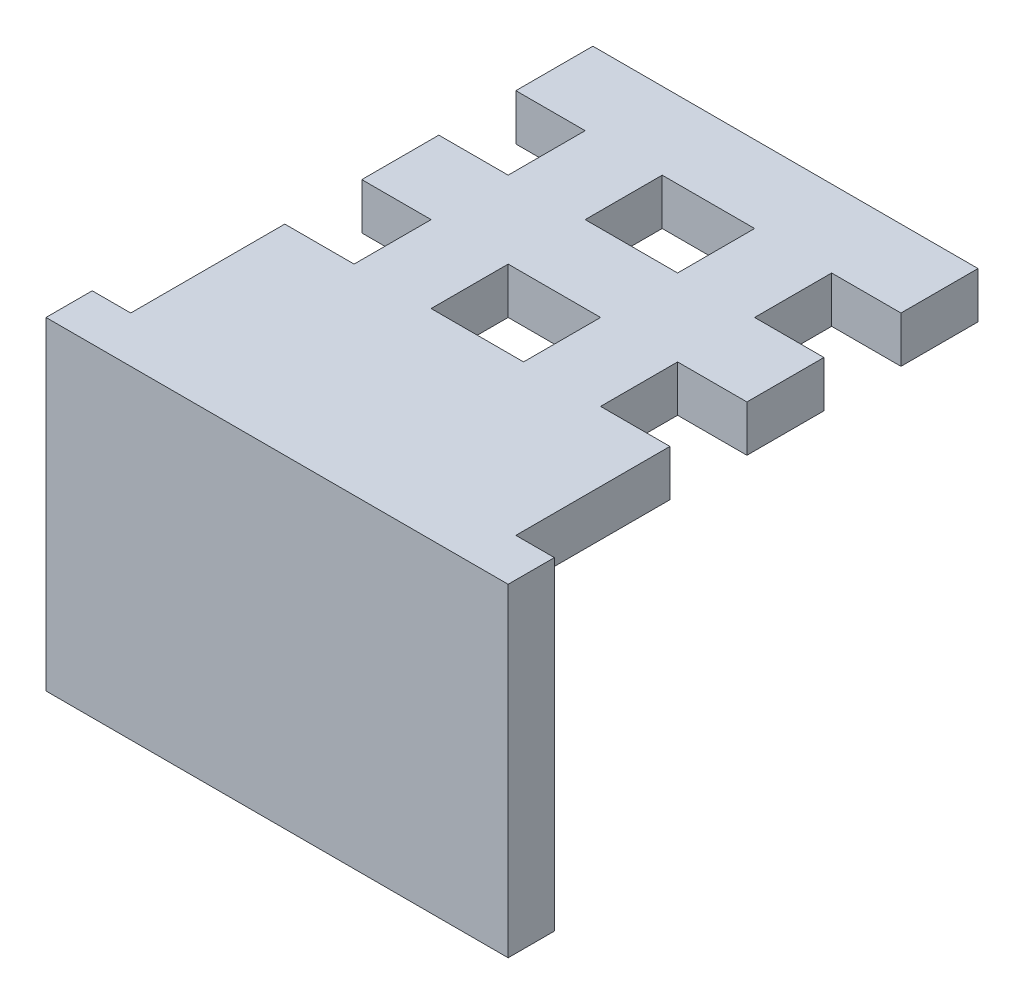
ISO-10303-21;
HEADER;
FILE_DESCRIPTION(('STEP AP214'),'2;1');
FILE_NAME('part.step','',(''),(''),'','','');
FILE_SCHEMA(('AUTOMOTIVE_DESIGN { 1 0 10303 214 1 1 1 1 }'));
ENDSEC;
DATA;
#1=APPLICATION_CONTEXT('core data for automotive mechanical design processes');
#2=APPLICATION_PROTOCOL_DEFINITION('international standard','automotive_design',2000,#1);
#3=PRODUCT_CONTEXT('',#1,'mechanical');
#4=PRODUCT('Part','Part','',(#3));
#5=PRODUCT_RELATED_PRODUCT_CATEGORY('part','',(#4));
#6=PRODUCT_DEFINITION_FORMATION('','',#4);
#7=PRODUCT_DEFINITION_CONTEXT('part definition',#1,'design');
#8=PRODUCT_DEFINITION('design','',#6,#7);
#9=PRODUCT_DEFINITION_SHAPE('','',#8);
#10=(LENGTH_UNIT() NAMED_UNIT(*) SI_UNIT(.MILLI.,.METRE.));
#11=(NAMED_UNIT(*) PLANE_ANGLE_UNIT() SI_UNIT($,.RADIAN.));
#12=(NAMED_UNIT(*) SI_UNIT($,.STERADIAN.) SOLID_ANGLE_UNIT());
#13=UNCERTAINTY_MEASURE_WITH_UNIT(LENGTH_MEASURE(1.E-05),#10,'distance_accuracy_value','');
#14=(GEOMETRIC_REPRESENTATION_CONTEXT(3) GLOBAL_UNCERTAINTY_ASSIGNED_CONTEXT((#13)) GLOBAL_UNIT_ASSIGNED_CONTEXT((#10,
#11,#12)) REPRESENTATION_CONTEXT('',''));
#15=CARTESIAN_POINT('',(0.,0.,0.));
#16=DIRECTION('',(0.,0.,1.));
#17=DIRECTION('',(1.,0.,0.));
#18=AXIS2_PLACEMENT_3D('',#15,#16,#17);
#19=CARTESIAN_POINT('',(0.,0.,-250.));
#20=DIRECTION('',(0.,0.,-1.));
#21=DIRECTION('',(-1.,0.,0.));
#22=AXIS2_PLACEMENT_3D('',#19,#20,#21);
#23=PLANE('',#22);
#24=DIRECTION('',(-1.,0.,0.));
#25=VECTOR('',#24,1.);
#26=CARTESIAN_POINT('',(125.,160.,-250.));
#27=LINE('',#26,#25);
#28=CARTESIAN_POINT('',(30.,160.,-250.));
#29=VERTEX_POINT('',#28);
#30=CARTESIAN_POINT('',(-30.,160.,-250.));
#31=VERTEX_POINT('',#30);
#32=EDGE_CURVE('E324',#29,#31,#27,.T.);
#33=ORIENTED_EDGE('',*,*,#32,.F.);
#34=DIRECTION('',(0.,-1.,0.));
#35=VECTOR('',#34,1.);
#36=CARTESIAN_POINT('',(30.,190.,-250.));
#37=LINE('',#36,#35);
#38=CARTESIAN_POINT('',(30.,190.,-250.));
#39=VERTEX_POINT('',#38);
#40=EDGE_CURVE('E419',#39,#29,#37,.T.);
#41=ORIENTED_EDGE('',*,*,#40,.F.);
#42=DIRECTION('',(1.,0.,0.));
#43=VECTOR('',#42,1.);
#44=CARTESIAN_POINT('',(125.,190.,-250.));
#45=LINE('',#44,#43);
#46=CARTESIAN_POINT('',(-30.,190.,-250.));
#47=VERTEX_POINT('',#46);
#48=EDGE_CURVE('E329',#47,#39,#45,.T.);
#49=ORIENTED_EDGE('',*,*,#48,.F.);
#50=DIRECTION('',(0.,1.,0.));
#51=VECTOR('',#50,1.);
#52=CARTESIAN_POINT('',(-30.,190.,-250.));
#53=LINE('',#52,#51);
#54=EDGE_CURVE('E288',#31,#47,#53,.T.);
#55=ORIENTED_EDGE('',*,*,#54,.F.);
#56=EDGE_LOOP('',(#33,#41,#49,#55));
#57=FACE_BOUND('',#56,.T.);
#58=ADVANCED_FACE('F36',(#57),#23,.F.);
#59=CARTESIAN_POINT('',(0.,0.,-200.));
#60=DIRECTION('',(0.,0.,-1.));
#61=DIRECTION('',(-1.,0.,0.));
#62=AXIS2_PLACEMENT_3D('',#59,#60,#61);
#63=PLANE('',#62);
#64=DIRECTION('',(0.,-1.,0.));
#65=VECTOR('',#64,1.);
#66=CARTESIAN_POINT('',(30.,190.,-200.));
#67=LINE('',#66,#65);
#68=CARTESIAN_POINT('',(30.,190.,-200.));
#69=VERTEX_POINT('',#68);
#70=CARTESIAN_POINT('',(30.,160.,-200.));
#71=VERTEX_POINT('',#70);
#72=EDGE_CURVE('E420',#69,#71,#67,.T.);
#73=ORIENTED_EDGE('',*,*,#72,.T.);
#74=DIRECTION('',(-1.,0.,0.));
#75=VECTOR('',#74,1.);
#76=CARTESIAN_POINT('',(125.,160.,-200.));
#77=LINE('',#76,#75);
#78=CARTESIAN_POINT('',(-30.,160.,-200.));
#79=VERTEX_POINT('',#78);
#80=EDGE_CURVE('E378',#71,#79,#77,.T.);
#81=ORIENTED_EDGE('',*,*,#80,.T.);
#82=DIRECTION('',(0.,1.,0.));
#83=VECTOR('',#82,1.);
#84=CARTESIAN_POINT('',(-30.,190.,-200.));
#85=LINE('',#84,#83);
#86=CARTESIAN_POINT('',(-30.,190.,-200.));
#87=VERTEX_POINT('',#86);
#88=EDGE_CURVE('E289',#79,#87,#85,.T.);
#89=ORIENTED_EDGE('',*,*,#88,.T.);
#90=DIRECTION('',(1.,0.,0.));
#91=VECTOR('',#90,1.);
#92=CARTESIAN_POINT('',(125.,190.,-200.));
#93=LINE('',#92,#91);
#94=EDGE_CURVE('E365',#87,#69,#93,.T.);
#95=ORIENTED_EDGE('',*,*,#94,.T.);
#96=EDGE_LOOP('',(#73,#81,#89,#95));
#97=FACE_BOUND('',#96,.T.);
#98=ADVANCED_FACE('F609',(#97),#63,.T.);
#99=DIRECTION('',(0.,-1.,0.));
#100=VECTOR('',#99,1.);
#101=CARTESIAN_POINT('',(-80.,190.,-250.));
#102=LINE('',#101,#100);
#103=CARTESIAN_POINT('',(-80.,190.,-250.));
#104=VERTEX_POINT('',#103);
#105=CARTESIAN_POINT('',(-80.,160.,-250.));
#106=VERTEX_POINT('',#105);
#107=EDGE_CURVE('E285',#104,#106,#102,.T.);
#108=ORIENTED_EDGE('',*,*,#107,.F.);
#109=CARTESIAN_POINT('',(-125.,190.,-250.));
#110=VERTEX_POINT('',#109);
#111=EDGE_CURVE('E310',#110,#104,#45,.T.);
#112=ORIENTED_EDGE('',*,*,#111,.F.);
#113=DIRECTION('',(0.,1.,0.));
#114=VECTOR('',#113,1.);
#115=CARTESIAN_POINT('',(-125.,190.,-250.));
#116=LINE('',#115,#114);
#117=CARTESIAN_POINT('',(-125.,160.,-250.));
#118=VERTEX_POINT('',#117);
#119=EDGE_CURVE('E323',#118,#110,#116,.T.);
#120=ORIENTED_EDGE('',*,*,#119,.F.);
#121=EDGE_CURVE('E319',#106,#118,#27,.T.);
#122=ORIENTED_EDGE('',*,*,#121,.F.);
#123=EDGE_LOOP('',(#108,#112,#120,#122));
#124=FACE_BOUND('',#123,.T.);
#125=ADVANCED_FACE('F344',(#124),#23,.F.);
#126=CARTESIAN_POINT('',(80.,190.,-250.));
#127=VERTEX_POINT('',#126);
#128=CARTESIAN_POINT('',(125.,190.,-250.));
#129=VERTEX_POINT('',#128);
#130=EDGE_CURVE('E326',#127,#129,#45,.T.);
#131=ORIENTED_EDGE('',*,*,#130,.F.);
#132=DIRECTION('',(0.,1.,0.));
#133=VECTOR('',#132,1.);
#134=CARTESIAN_POINT('',(80.,190.,-250.));
#135=LINE('',#134,#133);
#136=CARTESIAN_POINT('',(80.,160.,-250.));
#137=VERTEX_POINT('',#136);
#138=EDGE_CURVE('E59',#137,#127,#135,.T.);
#139=ORIENTED_EDGE('',*,*,#138,.F.);
#140=CARTESIAN_POINT('',(125.,160.,-250.));
#141=VERTEX_POINT('',#140);
#142=EDGE_CURVE('E320',#141,#137,#27,.T.);
#143=ORIENTED_EDGE('',*,*,#142,.F.);
#144=DIRECTION('',(0.,-1.,0.));
#145=VECTOR('',#144,1.);
#146=CARTESIAN_POINT('',(125.,190.,-250.));
#147=LINE('',#146,#145);
#148=EDGE_CURVE('E299',#129,#141,#147,.T.);
#149=ORIENTED_EDGE('',*,*,#148,.F.);
#150=EDGE_LOOP('',(#131,#139,#143,#149));
#151=FACE_BOUND('',#150,.T.);
#152=ADVANCED_FACE('F595',(#151),#23,.F.);
#153=CARTESIAN_POINT('',(125.,190.,-300.));
#154=DIRECTION('',(-1.,0.,0.));
#155=DIRECTION('',(0.,0.,1.));
#156=AXIS2_PLACEMENT_3D('',#153,#154,#155);
#157=PLANE('',#156);
#158=ORIENTED_EDGE('',*,*,#148,.T.);
#159=DIRECTION('',(0.,0.,1.));
#160=VECTOR('',#159,1.);
#161=CARTESIAN_POINT('',(125.,160.,-300.));
#162=LINE('',#161,#160);
#163=CARTESIAN_POINT('',(125.,160.,-300.));
#164=VERTEX_POINT('',#163);
#165=EDGE_CURVE('E11',#164,#141,#162,.T.);
#166=ORIENTED_EDGE('',*,*,#165,.F.);
#167=DIRECTION('',(0.,-1.,0.));
#168=VECTOR('',#167,1.);
#169=CARTESIAN_POINT('',(125.,190.,-300.));
#170=LINE('',#169,#168);
#171=CARTESIAN_POINT('',(125.,190.,-300.));
#172=VERTEX_POINT('',#171);
#173=EDGE_CURVE('E306',#172,#164,#170,.T.);
#174=ORIENTED_EDGE('',*,*,#173,.F.);
#175=DIRECTION('',(0.,0.,1.));
#176=VECTOR('',#175,1.);
#177=CARTESIAN_POINT('',(125.,190.,-300.));
#178=LINE('',#177,#176);
#179=EDGE_CURVE('E316',#172,#129,#178,.T.);
#180=ORIENTED_EDGE('',*,*,#179,.T.);
#181=EDGE_LOOP('',(#158,#166,#174,#180));
#182=FACE_BOUND('',#181,.T.);
#183=ADVANCED_FACE('F38',(#182),#157,.F.);
#184=CARTESIAN_POINT('',(125.,160.,-300.));
#185=DIRECTION('',(0.,1.,0.));
#186=DIRECTION('',(0.,0.,1.));
#187=AXIS2_PLACEMENT_3D('',#184,#185,#186);
#188=PLANE('',#187);
#189=CARTESIAN_POINT('',(-79.9999999999997,160.,-275.));
#190=DIRECTION('',(0.,-1.,0.));
#191=DIRECTION('',(0.,0.,-1.));
#192=AXIS2_PLACEMENT_3D('',#189,#190,#191);
#193=CIRCLE('',#192,10.);
#194=CARTESIAN_POINT('',(-79.9999999999997,160.,-285.));
#195=VERTEX_POINT('',#194);
#196=EDGE_CURVE('E440',#195,#195,#193,.T.);
#197=ORIENTED_EDGE('',*,*,#196,.F.);
#198=EDGE_LOOP('',(#197));
#199=FACE_BOUND('',#198,.T.);
#200=CARTESIAN_POINT('',(80.0000000000003,160.,-275.));
#201=DIRECTION('',(0.,-1.,0.));
#202=DIRECTION('',(0.,0.,-1.));
#203=AXIS2_PLACEMENT_3D('',#200,#201,#202);
#204=CIRCLE('',#203,10.);
#205=CARTESIAN_POINT('',(80.0000000000003,160.,-285.));
#206=VERTEX_POINT('',#205);
#207=EDGE_CURVE('E434',#206,#206,#204,.T.);
#208=ORIENTED_EDGE('',*,*,#207,.F.);
#209=EDGE_LOOP('',(#208));
#210=FACE_BOUND('',#209,.T.);
#211=CARTESIAN_POINT('',(0.,160.,-75.));
#212=DIRECTION('',(0.,-1.,0.));
#213=DIRECTION('',(0.,0.,-1.));
#214=AXIS2_PLACEMENT_3D('',#211,#212,#213);
#215=CIRCLE('',#214,9.99999999999999);
#216=CARTESIAN_POINT('',(0.,160.,-85.));
#217=VERTEX_POINT('',#216);
#218=EDGE_CURVE('E427',#217,#217,#215,.T.);
#219=ORIENTED_EDGE('',*,*,#218,.F.);
#220=EDGE_LOOP('',(#219));
#221=FACE_BOUND('',#220,.T.);
#222=ORIENTED_EDGE('',*,*,#142,.T.);
#223=DIRECTION('',(0.,0.,1.));
#224=VECTOR('',#223,1.);
#225=CARTESIAN_POINT('',(80.,160.,-250.));
#226=LINE('',#225,#224);
#227=CARTESIAN_POINT('',(80.,160.,-200.));
#228=VERTEX_POINT('',#227);
#229=EDGE_CURVE('E410',#137,#228,#226,.T.);
#230=ORIENTED_EDGE('',*,*,#229,.T.);
#231=CARTESIAN_POINT('',(125.,160.,-200.));
#232=VERTEX_POINT('',#231);
#233=EDGE_CURVE('E377',#232,#228,#77,.T.);
#234=ORIENTED_EDGE('',*,*,#233,.F.);
#235=DIRECTION('',(0.,0.,1.));
#236=VECTOR('',#235,1.);
#237=CARTESIAN_POINT('',(125.,160.,-200.));
#238=LINE('',#237,#236);
#239=CARTESIAN_POINT('',(125.,160.,-150.));
#240=VERTEX_POINT('',#239);
#241=EDGE_CURVE('E537',#232,#240,#238,.T.);
#242=ORIENTED_EDGE('',*,*,#241,.T.);
#243=DIRECTION('',(-1.,0.,0.));
#244=VECTOR('',#243,1.);
#245=CARTESIAN_POINT('',(125.,160.,-150.));
#246=LINE('',#245,#244);
#247=CARTESIAN_POINT('',(80.,160.,-150.));
#248=VERTEX_POINT('',#247);
#249=EDGE_CURVE('E550',#240,#248,#246,.T.);
#250=ORIENTED_EDGE('',*,*,#249,.T.);
#251=DIRECTION('',(0.,0.,-1.));
#252=VECTOR('',#251,1.);
#253=CARTESIAN_POINT('',(80.,160.,30.002));
#254=LINE('',#253,#252);
#255=CARTESIAN_POINT('',(80.,160.,-100.));
#256=VERTEX_POINT('',#255);
#257=EDGE_CURVE('E399',#256,#248,#254,.T.);
#258=ORIENTED_EDGE('',*,*,#257,.F.);
#259=DIRECTION('',(-1.,0.,0.));
#260=VECTOR('',#259,1.);
#261=CARTESIAN_POINT('',(125.,160.,-100.));
#262=LINE('',#261,#260);
#263=CARTESIAN_POINT('',(125.,160.,-100.));
#264=VERTEX_POINT('',#263);
#265=EDGE_CURVE('E496',#264,#256,#262,.T.);
#266=ORIENTED_EDGE('',*,*,#265,.F.);
#267=DIRECTION('',(0.,0.,1.));
#268=VECTOR('',#267,1.);
#269=CARTESIAN_POINT('',(125.,160.,-100.));
#270=LINE('',#269,#268);
#271=CARTESIAN_POINT('',(125.,160.,0.));
#272=VERTEX_POINT('',#271);
#273=EDGE_CURVE('E277',#264,#272,#270,.T.);
#274=ORIENTED_EDGE('',*,*,#273,.T.);
#275=DIRECTION('',(-1.,0.,0.));
#276=VECTOR('',#275,1.);
#277=CARTESIAN_POINT('',(125.,160.,0.));
#278=LINE('',#277,#276);
#279=CARTESIAN_POINT('',(-125.,160.,0.));
#280=VERTEX_POINT('',#279);
#281=EDGE_CURVE('E482',#272,#280,#278,.T.);
#282=ORIENTED_EDGE('',*,*,#281,.T.);
#283=DIRECTION('',(0.,0.,1.));
#284=VECTOR('',#283,1.);
#285=CARTESIAN_POINT('',(-125.,160.,-100.));
#286=LINE('',#285,#284);
#287=CARTESIAN_POINT('',(-125.,160.,-100.));
#288=VERTEX_POINT('',#287);
#289=EDGE_CURVE('E480',#288,#280,#286,.T.);
#290=ORIENTED_EDGE('',*,*,#289,.F.);
#291=CARTESIAN_POINT('',(-80.,160.,-100.));
#292=VERTEX_POINT('',#291);
#293=EDGE_CURVE('E515',#292,#288,#262,.T.);
#294=ORIENTED_EDGE('',*,*,#293,.F.);
#295=DIRECTION('',(0.,0.,-1.));
#296=VECTOR('',#295,1.);
#297=CARTESIAN_POINT('',(-80.,160.,30.002));
#298=LINE('',#297,#296);
#299=CARTESIAN_POINT('',(-80.,160.,-150.));
#300=VERTEX_POINT('',#299);
#301=EDGE_CURVE('E519',#292,#300,#298,.T.);
#302=ORIENTED_EDGE('',*,*,#301,.T.);
#303=CARTESIAN_POINT('',(-125.,160.,-150.));
#304=VERTEX_POINT('',#303);
#305=EDGE_CURVE('E553',#300,#304,#246,.T.);
#306=ORIENTED_EDGE('',*,*,#305,.T.);
#307=DIRECTION('',(0.,0.,1.));
#308=VECTOR('',#307,1.);
#309=CARTESIAN_POINT('',(-125.,160.,-200.));
#310=LINE('',#309,#308);
#311=CARTESIAN_POINT('',(-125.,160.,-200.));
#312=VERTEX_POINT('',#311);
#313=EDGE_CURVE('E540',#312,#304,#310,.T.);
#314=ORIENTED_EDGE('',*,*,#313,.F.);
#315=CARTESIAN_POINT('',(-80.,160.,-200.));
#316=VERTEX_POINT('',#315);
#317=EDGE_CURVE('E380',#316,#312,#77,.T.);
#318=ORIENTED_EDGE('',*,*,#317,.F.);
#319=DIRECTION('',(0.,0.,1.));
#320=VECTOR('',#319,1.);
#321=CARTESIAN_POINT('',(-80.,160.,-250.));
#322=LINE('',#321,#320);
#323=EDGE_CURVE('E292',#106,#316,#322,.T.);
#324=ORIENTED_EDGE('',*,*,#323,.F.);
#325=ORIENTED_EDGE('',*,*,#121,.T.);
#326=DIRECTION('',(0.,0.,1.));
#327=VECTOR('',#326,1.);
#328=CARTESIAN_POINT('',(-125.,160.,-300.));
#329=LINE('',#328,#327);
#330=CARTESIAN_POINT('',(-125.,160.,-300.));
#331=VERTEX_POINT('',#330);
#332=EDGE_CURVE('E44',#331,#118,#329,.T.);
#333=ORIENTED_EDGE('',*,*,#332,.F.);
#334=DIRECTION('',(-1.,0.,0.));
#335=VECTOR('',#334,1.);
#336=CARTESIAN_POINT('',(125.,160.,-300.));
#337=LINE('',#336,#335);
#338=EDGE_CURVE('E309',#164,#331,#337,.T.);
#339=ORIENTED_EDGE('',*,*,#338,.F.);
#340=ORIENTED_EDGE('',*,*,#165,.T.);
#341=EDGE_LOOP('',(#222,#230,#234,#242,#250,#258,#266,#274,#282,#290,#294,#302,#306,#314,#318,
#324,#325,#333,#339,#340));
#342=FACE_BOUND('',#341,.T.);
#343=DIRECTION('',(0.,0.,1.));
#344=VECTOR('',#343,1.);
#345=CARTESIAN_POINT('',(30.,160.,-250.));
#346=LINE('',#345,#344);
#347=EDGE_CURVE('E407',#29,#71,#346,.T.);
#348=ORIENTED_EDGE('',*,*,#347,.F.);
#349=ORIENTED_EDGE('',*,*,#32,.T.);
#350=DIRECTION('',(0.,0.,1.));
#351=VECTOR('',#350,1.);
#352=CARTESIAN_POINT('',(-30.,160.,-250.));
#353=LINE('',#352,#351);
#354=EDGE_CURVE('E302',#31,#79,#353,.T.);
#355=ORIENTED_EDGE('',*,*,#354,.T.);
#356=ORIENTED_EDGE('',*,*,#80,.F.);
#357=EDGE_LOOP('',(#348,#349,#355,#356));
#358=FACE_BOUND('',#357,.T.);
#359=CARTESIAN_POINT('',(30.,160.,-99.9999999999999));
#360=VERTEX_POINT('',#359);
#361=CARTESIAN_POINT('',(-30.,160.,-100.));
#362=VERTEX_POINT('',#361);
#363=EDGE_CURVE('E514',#360,#362,#262,.T.);
#364=ORIENTED_EDGE('',*,*,#363,.F.);
#365=DIRECTION('',(0.,0.,-1.));
#366=VECTOR('',#365,1.);
#367=CARTESIAN_POINT('',(30.,160.,30.002));
#368=LINE('',#367,#366);
#369=CARTESIAN_POINT('',(30.,160.,-150.));
#370=VERTEX_POINT('',#369);
#371=EDGE_CURVE('E392',#360,#370,#368,.T.);
#372=ORIENTED_EDGE('',*,*,#371,.T.);
#373=CARTESIAN_POINT('',(-30.,160.,-150.));
#374=VERTEX_POINT('',#373);
#375=EDGE_CURVE('E552',#370,#374,#246,.T.);
#376=ORIENTED_EDGE('',*,*,#375,.T.);
#377=DIRECTION('',(0.,0.,-1.));
#378=VECTOR('',#377,1.);
#379=CARTESIAN_POINT('',(-30.,160.,30.002));
#380=LINE('',#379,#378);
#381=EDGE_CURVE('E527',#362,#374,#380,.T.);
#382=ORIENTED_EDGE('',*,*,#381,.F.);
#383=EDGE_LOOP('',(#364,#372,#376,#382));
#384=FACE_BOUND('',#383,.T.);
#385=ADVANCED_FACE('F493',(#199,#210,#221,#342,#358,#384),#188,.F.);
#386=CARTESIAN_POINT('',(-125.,190.,-300.));
#387=DIRECTION('',(1.,0.,0.));
#388=DIRECTION('',(0.,1.,0.));
#389=AXIS2_PLACEMENT_3D('',#386,#387,#388);
#390=PLANE('',#389);
#391=ORIENTED_EDGE('',*,*,#119,.T.);
#392=DIRECTION('',(0.,0.,1.));
#393=VECTOR('',#392,1.);
#394=CARTESIAN_POINT('',(-125.,190.,-300.));
#395=LINE('',#394,#393);
#396=CARTESIAN_POINT('',(-125.,190.,-300.));
#397=VERTEX_POINT('',#396);
#398=EDGE_CURVE('E332',#397,#110,#395,.T.);
#399=ORIENTED_EDGE('',*,*,#398,.F.);
#400=DIRECTION('',(0.,1.,0.));
#401=VECTOR('',#400,1.);
#402=CARTESIAN_POINT('',(-125.,190.,-300.));
#403=LINE('',#402,#401);
#404=EDGE_CURVE('E312',#331,#397,#403,.T.);
#405=ORIENTED_EDGE('',*,*,#404,.F.);
#406=ORIENTED_EDGE('',*,*,#332,.T.);
#407=EDGE_LOOP('',(#391,#399,#405,#406));
#408=FACE_BOUND('',#407,.T.);
#409=ADVANCED_FACE('F339',(#408),#390,.F.);
#410=CARTESIAN_POINT('',(125.,190.,-300.));
#411=DIRECTION('',(0.,-1.,0.));
#412=DIRECTION('',(0.,0.,-1.));
#413=AXIS2_PLACEMENT_3D('',#410,#411,#412);
#414=PLANE('',#413);
#415=ORIENTED_EDGE('',*,*,#48,.T.);
#416=DIRECTION('',(0.,0.,1.));
#417=VECTOR('',#416,1.);
#418=CARTESIAN_POINT('',(30.,190.,-250.));
#419=LINE('',#418,#417);
#420=EDGE_CURVE('E406',#39,#69,#419,.T.);
#421=ORIENTED_EDGE('',*,*,#420,.T.);
#422=ORIENTED_EDGE('',*,*,#94,.F.);
#423=DIRECTION('',(0.,0.,1.));
#424=VECTOR('',#423,1.);
#425=CARTESIAN_POINT('',(-30.,190.,-250.));
#426=LINE('',#425,#424);
#427=EDGE_CURVE('E300',#47,#87,#426,.T.);
#428=ORIENTED_EDGE('',*,*,#427,.F.);
#429=EDGE_LOOP('',(#415,#421,#422,#428));
#430=FACE_BOUND('',#429,.T.);
#431=ORIENTED_EDGE('',*,*,#111,.T.);
#432=DIRECTION('',(0.,0.,1.));
#433=VECTOR('',#432,1.);
#434=CARTESIAN_POINT('',(-80.,190.,-250.));
#435=LINE('',#434,#433);
#436=CARTESIAN_POINT('',(-80.,190.,-200.));
#437=VERTEX_POINT('',#436);
#438=EDGE_CURVE('E297',#104,#437,#435,.T.);
#439=ORIENTED_EDGE('',*,*,#438,.T.);
#440=CARTESIAN_POINT('',(-125.,190.,-200.));
#441=VERTEX_POINT('',#440);
#442=EDGE_CURVE('E358',#441,#437,#93,.T.);
#443=ORIENTED_EDGE('',*,*,#442,.F.);
#444=DIRECTION('',(0.,0.,1.));
#445=VECTOR('',#444,1.);
#446=CARTESIAN_POINT('',(-125.,190.,-200.));
#447=LINE('',#446,#445);
#448=CARTESIAN_POINT('',(-125.,190.,-150.));
#449=VERTEX_POINT('',#448);
#450=EDGE_CURVE('E369',#441,#449,#447,.T.);
#451=ORIENTED_EDGE('',*,*,#450,.T.);
#452=DIRECTION('',(1.,0.,0.));
#453=VECTOR('',#452,1.);
#454=CARTESIAN_POINT('',(125.,190.,-150.));
#455=LINE('',#454,#453);
#456=CARTESIAN_POINT('',(-80.,190.,-150.));
#457=VERTEX_POINT('',#456);
#458=EDGE_CURVE('E384',#449,#457,#455,.T.);
#459=ORIENTED_EDGE('',*,*,#458,.T.);
#460=DIRECTION('',(0.,0.,-1.));
#461=VECTOR('',#460,1.);
#462=CARTESIAN_POINT('',(-80.,190.,30.002));
#463=LINE('',#462,#461);
#464=CARTESIAN_POINT('',(-80.,190.,-99.9999999999999));
#465=VERTEX_POINT('',#464);
#466=EDGE_CURVE('E520',#465,#457,#463,.T.);
#467=ORIENTED_EDGE('',*,*,#466,.F.);
#468=DIRECTION('',(1.,0.,0.));
#469=VECTOR('',#468,1.);
#470=CARTESIAN_POINT('',(125.,190.,-100.));
#471=LINE('',#470,#469);
#472=CARTESIAN_POINT('',(-125.,190.,-100.));
#473=VERTEX_POINT('',#472);
#474=EDGE_CURVE('E485',#473,#465,#471,.T.);
#475=ORIENTED_EDGE('',*,*,#474,.F.);
#476=DIRECTION('',(0.,0.,1.));
#477=VECTOR('',#476,1.);
#478=CARTESIAN_POINT('',(-125.,190.,-100.));
#479=LINE('',#478,#477);
#480=CARTESIAN_POINT('',(-125.,190.,0.));
#481=VERTEX_POINT('',#480);
#482=EDGE_CURVE('E477',#473,#481,#479,.T.);
#483=ORIENTED_EDGE('',*,*,#482,.T.);
#484=DIRECTION('',(-1.,0.,0.));
#485=VECTOR('',#484,1.);
#486=CARTESIAN_POINT('',(-150.,190.,0.));
#487=LINE('',#486,#485);
#488=CARTESIAN_POINT('',(-150.,190.,0.));
#489=VERTEX_POINT('',#488);
#490=EDGE_CURVE('E276',#481,#489,#487,.T.);
#491=ORIENTED_EDGE('',*,*,#490,.T.);
#492=DIRECTION('',(0.,0.,-1.));
#493=VECTOR('',#492,1.);
#494=CARTESIAN_POINT('',(-150.,190.,30.));
#495=LINE('',#494,#493);
#496=CARTESIAN_POINT('',(-150.,190.,30.));
#497=VERTEX_POINT('',#496);
#498=EDGE_CURVE('E266',#497,#489,#495,.T.);
#499=ORIENTED_EDGE('',*,*,#498,.F.);
#500=DIRECTION('',(-1.,0.,0.));
#501=VECTOR('',#500,1.);
#502=CARTESIAN_POINT('',(-150.,190.,30.));
#503=LINE('',#502,#501);
#504=CARTESIAN_POINT('',(150.,190.,30.));
#505=VERTEX_POINT('',#504);
#506=EDGE_CURVE('E264',#505,#497,#503,.T.);
#507=ORIENTED_EDGE('',*,*,#506,.F.);
#508=DIRECTION('',(0.,0.,-1.));
#509=VECTOR('',#508,1.);
#510=CARTESIAN_POINT('',(150.,190.,30.));
#511=LINE('',#510,#509);
#512=CARTESIAN_POINT('',(150.,190.,0.));
#513=VERTEX_POINT('',#512);
#514=EDGE_CURVE('E268',#505,#513,#511,.T.);
#515=ORIENTED_EDGE('',*,*,#514,.T.);
#516=CARTESIAN_POINT('',(125.,190.,0.));
#517=VERTEX_POINT('',#516);
#518=EDGE_CURVE('E278',#513,#517,#487,.T.);
#519=ORIENTED_EDGE('',*,*,#518,.T.);
#520=DIRECTION('',(0.,0.,1.));
#521=VECTOR('',#520,1.);
#522=CARTESIAN_POINT('',(125.,190.,-100.));
#523=LINE('',#522,#521);
#524=CARTESIAN_POINT('',(125.,190.,-100.));
#525=VERTEX_POINT('',#524);
#526=EDGE_CURVE('E486',#525,#517,#523,.T.);
#527=ORIENTED_EDGE('',*,*,#526,.F.);
#528=CARTESIAN_POINT('',(80.,190.,-100.));
#529=VERTEX_POINT('',#528);
#530=EDGE_CURVE('E510',#529,#525,#471,.T.);
#531=ORIENTED_EDGE('',*,*,#530,.F.);
#532=DIRECTION('',(0.,0.,-1.));
#533=VECTOR('',#532,1.);
#534=CARTESIAN_POINT('',(80.,190.,30.002));
#535=LINE('',#534,#533);
#536=CARTESIAN_POINT('',(80.,190.,-150.));
#537=VERTEX_POINT('',#536);
#538=EDGE_CURVE('E395',#529,#537,#535,.T.);
#539=ORIENTED_EDGE('',*,*,#538,.T.);
#540=CARTESIAN_POINT('',(125.,190.,-150.));
#541=VERTEX_POINT('',#540);
#542=EDGE_CURVE('E547',#537,#541,#455,.T.);
#543=ORIENTED_EDGE('',*,*,#542,.T.);
#544=DIRECTION('',(0.,0.,1.));
#545=VECTOR('',#544,1.);
#546=CARTESIAN_POINT('',(125.,190.,-200.));
#547=LINE('',#546,#545);
#548=CARTESIAN_POINT('',(125.,190.,-200.));
#549=VERTEX_POINT('',#548);
#550=EDGE_CURVE('E364',#549,#541,#547,.T.);
#551=ORIENTED_EDGE('',*,*,#550,.F.);
#552=CARTESIAN_POINT('',(80.,190.,-200.));
#553=VERTEX_POINT('',#552);
#554=EDGE_CURVE('E367',#553,#549,#93,.T.);
#555=ORIENTED_EDGE('',*,*,#554,.F.);
#556=DIRECTION('',(0.,0.,1.));
#557=VECTOR('',#556,1.);
#558=CARTESIAN_POINT('',(80.,190.,-250.));
#559=LINE('',#558,#557);
#560=EDGE_CURVE('E413',#127,#553,#559,.T.);
#561=ORIENTED_EDGE('',*,*,#560,.F.);
#562=ORIENTED_EDGE('',*,*,#130,.T.);
#563=ORIENTED_EDGE('',*,*,#179,.F.);
#564=DIRECTION('',(1.,0.,0.));
#565=VECTOR('',#564,1.);
#566=CARTESIAN_POINT('',(125.,190.,-300.));
#567=LINE('',#566,#565);
#568=EDGE_CURVE('E314',#397,#172,#567,.T.);
#569=ORIENTED_EDGE('',*,*,#568,.F.);
#570=ORIENTED_EDGE('',*,*,#398,.T.);
#571=EDGE_LOOP('',(#431,#439,#443,#451,#459,#467,#475,#483,#491,#499,#507,#515,#519,#527,#531,
#539,#543,#551,#555,#561,#562,#563,#569,#570));
#572=FACE_BOUND('',#571,.T.);
#573=DIRECTION('',(0.,0.,-1.));
#574=VECTOR('',#573,1.);
#575=CARTESIAN_POINT('',(30.,190.,30.002));
#576=LINE('',#575,#574);
#577=CARTESIAN_POINT('',(30.,190.,-100.));
#578=VERTEX_POINT('',#577);
#579=CARTESIAN_POINT('',(30.,190.,-150.));
#580=VERTEX_POINT('',#579);
#581=EDGE_CURVE('E393',#578,#580,#576,.T.);
#582=ORIENTED_EDGE('',*,*,#581,.F.);
#583=CARTESIAN_POINT('',(-30.,190.,-100.));
#584=VERTEX_POINT('',#583);
#585=EDGE_CURVE('E509',#584,#578,#471,.T.);
#586=ORIENTED_EDGE('',*,*,#585,.F.);
#587=DIRECTION('',(0.,0.,-1.));
#588=VECTOR('',#587,1.);
#589=CARTESIAN_POINT('',(-30.,190.,30.002));
#590=LINE('',#589,#588);
#591=CARTESIAN_POINT('',(-30.,190.,-150.));
#592=VERTEX_POINT('',#591);
#593=EDGE_CURVE('E523',#584,#592,#590,.T.);
#594=ORIENTED_EDGE('',*,*,#593,.T.);
#595=EDGE_CURVE('E546',#592,#580,#455,.T.);
#596=ORIENTED_EDGE('',*,*,#595,.T.);
#597=EDGE_LOOP('',(#582,#586,#594,#596));
#598=FACE_BOUND('',#597,.T.);
#599=ADVANCED_FACE('F348',(#430,#572,#598),#414,.F.);
#600=CARTESIAN_POINT('',(0.,0.,-300.));
#601=DIRECTION('',(0.,0.,-1.));
#602=DIRECTION('',(-1.,0.,0.));
#603=AXIS2_PLACEMENT_3D('',#600,#601,#602);
#604=PLANE('',#603);
#605=ORIENTED_EDGE('',*,*,#173,.T.);
#606=ORIENTED_EDGE('',*,*,#338,.T.);
#607=ORIENTED_EDGE('',*,*,#404,.T.);
#608=ORIENTED_EDGE('',*,*,#568,.T.);
#609=EDGE_LOOP('',(#605,#606,#607,#608));
#610=FACE_BOUND('',#609,.T.);
#611=ADVANCED_FACE('F682',(#610),#604,.T.);
#612=CARTESIAN_POINT('',(-80.,190.,-250.));
#613=DIRECTION('',(-1.,0.,0.));
#614=DIRECTION('',(0.,0.,1.));
#615=AXIS2_PLACEMENT_3D('',#612,#613,#614);
#616=PLANE('',#615);
#617=DIRECTION('',(0.,-1.,0.));
#618=VECTOR('',#617,1.);
#619=CARTESIAN_POINT('',(-80.,190.,-200.));
#620=LINE('',#619,#618);
#621=EDGE_CURVE('E284',#437,#316,#620,.T.);
#622=ORIENTED_EDGE('',*,*,#621,.F.);
#623=ORIENTED_EDGE('',*,*,#438,.F.);
#624=ORIENTED_EDGE('',*,*,#107,.T.);
#625=ORIENTED_EDGE('',*,*,#323,.T.);
#626=EDGE_LOOP('',(#622,#623,#624,#625));
#627=FACE_BOUND('',#626,.T.);
#628=ADVANCED_FACE('F354',(#627),#616,.T.);
#629=CARTESIAN_POINT('',(-30.,190.,-250.));
#630=DIRECTION('',(1.,0.,0.));
#631=DIRECTION('',(0.,1.,0.));
#632=AXIS2_PLACEMENT_3D('',#629,#630,#631);
#633=PLANE('',#632);
#634=ORIENTED_EDGE('',*,*,#88,.F.);
#635=ORIENTED_EDGE('',*,*,#354,.F.);
#636=ORIENTED_EDGE('',*,*,#54,.T.);
#637=ORIENTED_EDGE('',*,*,#427,.T.);
#638=EDGE_LOOP('',(#634,#635,#636,#637));
#639=FACE_BOUND('',#638,.T.);
#640=ADVANCED_FACE('F612',(#639),#633,.T.);
#641=ORIENTED_EDGE('',*,*,#442,.T.);
#642=ORIENTED_EDGE('',*,*,#621,.T.);
#643=ORIENTED_EDGE('',*,*,#317,.T.);
#644=DIRECTION('',(0.,1.,0.));
#645=VECTOR('',#644,1.);
#646=CARTESIAN_POINT('',(-125.,190.,-200.));
#647=LINE('',#646,#645);
#648=EDGE_CURVE('E361',#312,#441,#647,.T.);
#649=ORIENTED_EDGE('',*,*,#648,.T.);
#650=EDGE_LOOP('',(#641,#642,#643,#649));
#651=FACE_BOUND('',#650,.T.);
#652=ADVANCED_FACE('F359',(#651),#63,.T.);
#653=CARTESIAN_POINT('',(0.,0.,-100.));
#654=DIRECTION('',(0.,0.,-1.));
#655=DIRECTION('',(-1.,0.,0.));
#656=AXIS2_PLACEMENT_3D('',#653,#654,#655);
#657=PLANE('',#656);
#658=ORIENTED_EDGE('',*,*,#265,.T.);
#659=DIRECTION('',(0.,-1.,0.));
#660=VECTOR('',#659,1.);
#661=CARTESIAN_POINT('',(80.,190.,-100.));
#662=LINE('',#661,#660);
#663=EDGE_CURVE('E389',#529,#256,#662,.T.);
#664=ORIENTED_EDGE('',*,*,#663,.F.);
#665=ORIENTED_EDGE('',*,*,#530,.T.);
#666=DIRECTION('',(0.,-1.,0.));
#667=VECTOR('',#666,1.);
#668=CARTESIAN_POINT('',(125.,190.,-100.));
#669=LINE('',#668,#667);
#670=EDGE_CURVE('E481',#525,#264,#669,.T.);
#671=ORIENTED_EDGE('',*,*,#670,.T.);
#672=EDGE_LOOP('',(#658,#664,#665,#671));
#673=FACE_BOUND('',#672,.T.);
#674=ADVANCED_FACE('F578',(#673),#657,.T.);
#675=ORIENTED_EDGE('',*,*,#585,.T.);
#676=DIRECTION('',(0.,1.,0.));
#677=VECTOR('',#676,1.);
#678=CARTESIAN_POINT('',(30.,190.,-100.));
#679=LINE('',#678,#677);
#680=EDGE_CURVE('E385',#360,#578,#679,.T.);
#681=ORIENTED_EDGE('',*,*,#680,.F.);
#682=ORIENTED_EDGE('',*,*,#363,.T.);
#683=DIRECTION('',(0.,-1.,0.));
#684=VECTOR('',#683,1.);
#685=CARTESIAN_POINT('',(-30.,190.,-100.));
#686=LINE('',#685,#684);
#687=EDGE_CURVE('E505',#584,#362,#686,.T.);
#688=ORIENTED_EDGE('',*,*,#687,.F.);
#689=EDGE_LOOP('',(#675,#681,#682,#688));
#690=FACE_BOUND('',#689,.T.);
#691=ADVANCED_FACE('F573',(#690),#657,.T.);
#692=CARTESIAN_POINT('',(0.,0.,-150.));
#693=DIRECTION('',(0.,0.,-1.));
#694=DIRECTION('',(-1.,0.,0.));
#695=AXIS2_PLACEMENT_3D('',#692,#693,#694);
#696=PLANE('',#695);
#697=DIRECTION('',(0.,1.,0.));
#698=VECTOR('',#697,1.);
#699=CARTESIAN_POINT('',(80.,190.,-150.));
#700=LINE('',#699,#698);
#701=EDGE_CURVE('E396',#248,#537,#700,.T.);
#702=ORIENTED_EDGE('',*,*,#701,.F.);
#703=ORIENTED_EDGE('',*,*,#249,.F.);
#704=DIRECTION('',(0.,-1.,0.));
#705=VECTOR('',#704,1.);
#706=CARTESIAN_POINT('',(125.,190.,-150.));
#707=LINE('',#706,#705);
#708=EDGE_CURVE('E388',#541,#240,#707,.T.);
#709=ORIENTED_EDGE('',*,*,#708,.F.);
#710=ORIENTED_EDGE('',*,*,#542,.F.);
#711=EDGE_LOOP('',(#702,#703,#709,#710));
#712=FACE_BOUND('',#711,.T.);
#713=ADVANCED_FACE('F585',(#712),#696,.F.);
#714=DIRECTION('',(0.,-1.,0.));
#715=VECTOR('',#714,1.);
#716=CARTESIAN_POINT('',(30.,190.,-150.));
#717=LINE('',#716,#715);
#718=EDGE_CURVE('E403',#580,#370,#717,.T.);
#719=ORIENTED_EDGE('',*,*,#718,.F.);
#720=ORIENTED_EDGE('',*,*,#595,.F.);
#721=DIRECTION('',(0.,1.,0.));
#722=VECTOR('',#721,1.);
#723=CARTESIAN_POINT('',(-30.,190.,-150.));
#724=LINE('',#723,#722);
#725=EDGE_CURVE('E524',#374,#592,#724,.T.);
#726=ORIENTED_EDGE('',*,*,#725,.F.);
#727=ORIENTED_EDGE('',*,*,#375,.F.);
#728=EDGE_LOOP('',(#719,#720,#726,#727));
#729=FACE_BOUND('',#728,.T.);
#730=ADVANCED_FACE('F566',(#729),#696,.F.);
#731=CARTESIAN_POINT('',(0.,0.,0.));
#732=DIRECTION('',(0.,0.,1.));
#733=DIRECTION('',(1.,0.,0.));
#734=AXIS2_PLACEMENT_3D('',#731,#732,#733);
#735=PLANE('',#734);
#736=CARTESIAN_POINT('',(45.,39.9999999999999,0.));
#737=DIRECTION('',(0.,0.,-1.));
#738=DIRECTION('',(-1.,0.,0.));
#739=AXIS2_PLACEMENT_3D('',#736,#737,#738);
#740=CIRCLE('',#739,5.);
#741=CARTESIAN_POINT('',(40.,39.9999999999999,0.));
#742=VERTEX_POINT('',#741);
#743=EDGE_CURVE('E451',#742,#742,#740,.T.);
#744=ORIENTED_EDGE('',*,*,#743,.F.);
#745=EDGE_LOOP('',(#744));
#746=FACE_BOUND('',#745,.T.);
#747=CARTESIAN_POINT('',(-45.,39.9999999999999,0.));
#748=DIRECTION('',(0.,0.,-1.));
#749=DIRECTION('',(1.,0.,0.));
#750=AXIS2_PLACEMENT_3D('',#747,#748,#749);
#751=CIRCLE('',#750,5.);
#752=CARTESIAN_POINT('',(-40.,39.9999999999999,0.));
#753=VERTEX_POINT('',#752);
#754=EDGE_CURVE('E445',#753,#753,#751,.T.);
#755=ORIENTED_EDGE('',*,*,#754,.F.);
#756=EDGE_LOOP('',(#755));
#757=FACE_BOUND('',#756,.T.);
#758=DIRECTION('',(0.,1.,0.));
#759=VECTOR('',#758,1.);
#760=CARTESIAN_POINT('',(150.,190.,0.));
#761=LINE('',#760,#759);
#762=CARTESIAN_POINT('',(150.,-20.,0.));
#763=VERTEX_POINT('',#762);
#764=EDGE_CURVE('E274',#763,#513,#761,.T.);
#765=ORIENTED_EDGE('',*,*,#764,.F.);
#766=DIRECTION('',(1.,0.,0.));
#767=VECTOR('',#766,1.);
#768=CARTESIAN_POINT('',(150.,-20.,0.));
#769=LINE('',#768,#767);
#770=CARTESIAN_POINT('',(-150.,-20.,0.));
#771=VERTEX_POINT('',#770);
#772=EDGE_CURVE('E251',#771,#763,#769,.T.);
#773=ORIENTED_EDGE('',*,*,#772,.F.);
#774=DIRECTION('',(0.,-1.,0.));
#775=VECTOR('',#774,1.);
#776=CARTESIAN_POINT('',(-150.,190.,0.));
#777=LINE('',#776,#775);
#778=EDGE_CURVE('E260',#489,#771,#777,.T.);
#779=ORIENTED_EDGE('',*,*,#778,.F.);
#780=ORIENTED_EDGE('',*,*,#490,.F.);
#781=DIRECTION('',(0.,1.,0.));
#782=VECTOR('',#781,1.);
#783=CARTESIAN_POINT('',(-125.,190.,0.));
#784=LINE('',#783,#782);
#785=EDGE_CURVE('E470',#280,#481,#784,.T.);
#786=ORIENTED_EDGE('',*,*,#785,.F.);
#787=ORIENTED_EDGE('',*,*,#281,.F.);
#788=DIRECTION('',(0.,-1.,0.));
#789=VECTOR('',#788,1.);
#790=CARTESIAN_POINT('',(125.,190.,0.));
#791=LINE('',#790,#789);
#792=EDGE_CURVE('E465',#517,#272,#791,.T.);
#793=ORIENTED_EDGE('',*,*,#792,.F.);
#794=ORIENTED_EDGE('',*,*,#518,.F.);
#795=EDGE_LOOP('',(#765,#773,#779,#780,#786,#787,#793,#794));
#796=FACE_BOUND('',#795,.T.);
#797=ADVANCED_FACE('F463',(#746,#757,#796),#735,.F.);
#798=CARTESIAN_POINT('',(150.,190.,30.));
#799=DIRECTION('',(-1.,0.,0.));
#800=DIRECTION('',(0.,-1.,0.));
#801=AXIS2_PLACEMENT_3D('',#798,#799,#800);
#802=PLANE('',#801);
#803=DIRECTION('',(0.,1.,0.));
#804=VECTOR('',#803,1.);
#805=CARTESIAN_POINT('',(150.,190.,30.));
#806=LINE('',#805,#804);
#807=CARTESIAN_POINT('',(150.,-20.,30.));
#808=VERTEX_POINT('',#807);
#809=EDGE_CURVE('E270',#808,#505,#806,.T.);
#810=ORIENTED_EDGE('',*,*,#809,.F.);
#811=DIRECTION('',(0.,0.,-1.));
#812=VECTOR('',#811,1.);
#813=CARTESIAN_POINT('',(150.,-20.,30.));
#814=LINE('',#813,#812);
#815=EDGE_CURVE('E51',#808,#763,#814,.T.);
#816=ORIENTED_EDGE('',*,*,#815,.T.);
#817=ORIENTED_EDGE('',*,*,#764,.T.);
#818=ORIENTED_EDGE('',*,*,#514,.F.);
#819=EDGE_LOOP('',(#810,#816,#817,#818));
#820=FACE_BOUND('',#819,.T.);
#821=ADVANCED_FACE('F460',(#820),#802,.F.);
#822=CARTESIAN_POINT('',(-150.,190.,30.));
#823=DIRECTION('',(1.,0.,0.));
#824=DIRECTION('',(0.,1.,0.));
#825=AXIS2_PLACEMENT_3D('',#822,#823,#824);
#826=PLANE('',#825);
#827=ORIENTED_EDGE('',*,*,#778,.T.);
#828=DIRECTION('',(0.,0.,-1.));
#829=VECTOR('',#828,1.);
#830=CARTESIAN_POINT('',(-150.,-20.,30.));
#831=LINE('',#830,#829);
#832=CARTESIAN_POINT('',(-150.,-20.,30.));
#833=VERTEX_POINT('',#832);
#834=EDGE_CURVE('E246',#833,#771,#831,.T.);
#835=ORIENTED_EDGE('',*,*,#834,.F.);
#836=DIRECTION('',(0.,-1.,0.));
#837=VECTOR('',#836,1.);
#838=CARTESIAN_POINT('',(-150.,190.,30.));
#839=LINE('',#838,#837);
#840=EDGE_CURVE('E258',#497,#833,#839,.T.);
#841=ORIENTED_EDGE('',*,*,#840,.F.);
#842=ORIENTED_EDGE('',*,*,#498,.T.);
#843=EDGE_LOOP('',(#827,#835,#841,#842));
#844=FACE_BOUND('',#843,.T.);
#845=ADVANCED_FACE('F256',(#844),#826,.F.);
#846=CARTESIAN_POINT('',(0.,0.,30.));
#847=DIRECTION('',(0.,0.,1.));
#848=DIRECTION('',(1.,0.,0.));
#849=AXIS2_PLACEMENT_3D('',#846,#847,#848);
#850=PLANE('',#849);
#851=DIRECTION('',(1.,0.,0.));
#852=VECTOR('',#851,1.);
#853=CARTESIAN_POINT('',(150.,-20.,30.));
#854=LINE('',#853,#852);
#855=EDGE_CURVE('E243',#833,#808,#854,.T.);
#856=ORIENTED_EDGE('',*,*,#855,.T.);
#857=ORIENTED_EDGE('',*,*,#809,.T.);
#858=ORIENTED_EDGE('',*,*,#506,.T.);
#859=ORIENTED_EDGE('',*,*,#840,.T.);
#860=EDGE_LOOP('',(#856,#857,#858,#859));
#861=FACE_BOUND('',#860,.T.);
#862=ADVANCED_FACE('F262',(#861),#850,.T.);
#863=CARTESIAN_POINT('',(125.,190.,-100.));
#864=DIRECTION('',(-1.,0.,0.));
#865=DIRECTION('',(0.,0.,1.));
#866=AXIS2_PLACEMENT_3D('',#863,#864,#865);
#867=PLANE('',#866);
#868=ORIENTED_EDGE('',*,*,#792,.T.);
#869=ORIENTED_EDGE('',*,*,#273,.F.);
#870=ORIENTED_EDGE('',*,*,#670,.F.);
#871=ORIENTED_EDGE('',*,*,#526,.T.);
#872=EDGE_LOOP('',(#868,#869,#870,#871));
#873=FACE_BOUND('',#872,.T.);
#874=ADVANCED_FACE('F500',(#873),#867,.F.);
#875=CARTESIAN_POINT('',(-125.,190.,-100.));
#876=DIRECTION('',(1.,0.,0.));
#877=DIRECTION('',(0.,1.,0.));
#878=AXIS2_PLACEMENT_3D('',#875,#876,#877);
#879=PLANE('',#878);
#880=ORIENTED_EDGE('',*,*,#785,.T.);
#881=ORIENTED_EDGE('',*,*,#482,.F.);
#882=DIRECTION('',(0.,1.,0.));
#883=VECTOR('',#882,1.);
#884=CARTESIAN_POINT('',(-125.,190.,-100.));
#885=LINE('',#884,#883);
#886=EDGE_CURVE('E511',#288,#473,#885,.T.);
#887=ORIENTED_EDGE('',*,*,#886,.F.);
#888=ORIENTED_EDGE('',*,*,#289,.T.);
#889=EDGE_LOOP('',(#880,#881,#887,#888));
#890=FACE_BOUND('',#889,.T.);
#891=ADVANCED_FACE('F475',(#890),#879,.F.);
#892=DIRECTION('',(0.,1.,0.));
#893=VECTOR('',#892,1.);
#894=CARTESIAN_POINT('',(-80.,190.,-100.));
#895=LINE('',#894,#893);
#896=EDGE_CURVE('E501',#292,#465,#895,.T.);
#897=ORIENTED_EDGE('',*,*,#896,.F.);
#898=ORIENTED_EDGE('',*,*,#293,.T.);
#899=ORIENTED_EDGE('',*,*,#886,.T.);
#900=ORIENTED_EDGE('',*,*,#474,.T.);
#901=EDGE_LOOP('',(#897,#898,#899,#900));
#902=FACE_BOUND('',#901,.T.);
#903=ADVANCED_FACE('F624',(#902),#657,.T.);
#904=CARTESIAN_POINT('',(-30.,190.,30.002));
#905=DIRECTION('',(-1.,0.,0.));
#906=DIRECTION('',(0.,-1.,0.));
#907=AXIS2_PLACEMENT_3D('',#904,#905,#906);
#908=PLANE('',#907);
#909=ORIENTED_EDGE('',*,*,#593,.F.);
#910=ORIENTED_EDGE('',*,*,#687,.T.);
#911=ORIENTED_EDGE('',*,*,#381,.T.);
#912=ORIENTED_EDGE('',*,*,#725,.T.);
#913=EDGE_LOOP('',(#909,#910,#911,#912));
#914=FACE_BOUND('',#913,.T.);
#915=ADVANCED_FACE('F570',(#914),#908,.F.);
#916=CARTESIAN_POINT('',(-80.,190.,30.002));
#917=DIRECTION('',(1.,0.,0.));
#918=DIRECTION('',(0.,0.,-1.));
#919=AXIS2_PLACEMENT_3D('',#916,#917,#918);
#920=PLANE('',#919);
#921=ORIENTED_EDGE('',*,*,#301,.F.);
#922=ORIENTED_EDGE('',*,*,#896,.T.);
#923=ORIENTED_EDGE('',*,*,#466,.T.);
#924=DIRECTION('',(0.,-1.,0.));
#925=VECTOR('',#924,1.);
#926=CARTESIAN_POINT('',(-80.,190.,-150.));
#927=LINE('',#926,#925);
#928=EDGE_CURVE('E534',#457,#300,#927,.T.);
#929=ORIENTED_EDGE('',*,*,#928,.T.);
#930=EDGE_LOOP('',(#921,#922,#923,#929));
#931=FACE_BOUND('',#930,.T.);
#932=ADVANCED_FACE('F621',(#931),#920,.F.);
#933=ORIENTED_EDGE('',*,*,#928,.F.);
#934=ORIENTED_EDGE('',*,*,#458,.F.);
#935=DIRECTION('',(0.,1.,0.));
#936=VECTOR('',#935,1.);
#937=CARTESIAN_POINT('',(-125.,190.,-150.));
#938=LINE('',#937,#936);
#939=EDGE_CURVE('E548',#304,#449,#938,.T.);
#940=ORIENTED_EDGE('',*,*,#939,.F.);
#941=ORIENTED_EDGE('',*,*,#305,.F.);
#942=EDGE_LOOP('',(#933,#934,#940,#941));
#943=FACE_BOUND('',#942,.T.);
#944=ADVANCED_FACE('F618',(#943),#696,.F.);
#945=CARTESIAN_POINT('',(125.,190.,-200.));
#946=DIRECTION('',(-1.,0.,0.));
#947=DIRECTION('',(0.,0.,1.));
#948=AXIS2_PLACEMENT_3D('',#945,#946,#947);
#949=PLANE('',#948);
#950=ORIENTED_EDGE('',*,*,#708,.T.);
#951=ORIENTED_EDGE('',*,*,#241,.F.);
#952=DIRECTION('',(0.,-1.,0.));
#953=VECTOR('',#952,1.);
#954=CARTESIAN_POINT('',(125.,190.,-200.));
#955=LINE('',#954,#953);
#956=EDGE_CURVE('E382',#549,#232,#955,.T.);
#957=ORIENTED_EDGE('',*,*,#956,.F.);
#958=ORIENTED_EDGE('',*,*,#550,.T.);
#959=EDGE_LOOP('',(#950,#951,#957,#958));
#960=FACE_BOUND('',#959,.T.);
#961=ADVANCED_FACE('F587',(#960),#949,.F.);
#962=CARTESIAN_POINT('',(-125.,190.,-200.));
#963=DIRECTION('',(1.,0.,0.));
#964=DIRECTION('',(0.,1.,0.));
#965=AXIS2_PLACEMENT_3D('',#962,#963,#964);
#966=PLANE('',#965);
#967=ORIENTED_EDGE('',*,*,#939,.T.);
#968=ORIENTED_EDGE('',*,*,#450,.F.);
#969=ORIENTED_EDGE('',*,*,#648,.F.);
#970=ORIENTED_EDGE('',*,*,#313,.T.);
#971=EDGE_LOOP('',(#967,#968,#969,#970));
#972=FACE_BOUND('',#971,.T.);
#973=ADVANCED_FACE('F615',(#972),#966,.F.);
#974=DIRECTION('',(0.,1.,0.));
#975=VECTOR('',#974,1.);
#976=CARTESIAN_POINT('',(80.,190.,-200.));
#977=LINE('',#976,#975);
#978=EDGE_CURVE('E417',#228,#553,#977,.T.);
#979=ORIENTED_EDGE('',*,*,#978,.T.);
#980=ORIENTED_EDGE('',*,*,#554,.T.);
#981=ORIENTED_EDGE('',*,*,#956,.T.);
#982=ORIENTED_EDGE('',*,*,#233,.T.);
#983=EDGE_LOOP('',(#979,#980,#981,#982));
#984=FACE_BOUND('',#983,.T.);
#985=ADVANCED_FACE('F588',(#984),#63,.T.);
#986=CARTESIAN_POINT('',(80.,190.,30.002));
#987=DIRECTION('',(-1.,0.,0.));
#988=DIRECTION('',(0.,0.,1.));
#989=AXIS2_PLACEMENT_3D('',#986,#987,#988);
#990=PLANE('',#989);
#991=ORIENTED_EDGE('',*,*,#538,.F.);
#992=ORIENTED_EDGE('',*,*,#663,.T.);
#993=ORIENTED_EDGE('',*,*,#257,.T.);
#994=ORIENTED_EDGE('',*,*,#701,.T.);
#995=EDGE_LOOP('',(#991,#992,#993,#994));
#996=FACE_BOUND('',#995,.T.);
#997=ADVANCED_FACE('F582',(#996),#990,.F.);
#998=CARTESIAN_POINT('',(30.,190.,30.002));
#999=DIRECTION('',(1.,0.,0.));
#1000=DIRECTION('',(0.,1.,0.));
#1001=AXIS2_PLACEMENT_3D('',#998,#999,#1000);
#1002=PLANE('',#1001);
#1003=ORIENTED_EDGE('',*,*,#371,.F.);
#1004=ORIENTED_EDGE('',*,*,#680,.T.);
#1005=ORIENTED_EDGE('',*,*,#581,.T.);
#1006=ORIENTED_EDGE('',*,*,#718,.T.);
#1007=EDGE_LOOP('',(#1003,#1004,#1005,#1006));
#1008=FACE_BOUND('',#1007,.T.);
#1009=ADVANCED_FACE('F808',(#1008),#1002,.F.);
#1010=CARTESIAN_POINT('',(30.,190.,-250.));
#1011=DIRECTION('',(-1.,0.,0.));
#1012=DIRECTION('',(0.,-1.,0.));
#1013=AXIS2_PLACEMENT_3D('',#1010,#1011,#1012);
#1014=PLANE('',#1013);
#1015=ORIENTED_EDGE('',*,*,#72,.F.);
#1016=ORIENTED_EDGE('',*,*,#420,.F.);
#1017=ORIENTED_EDGE('',*,*,#40,.T.);
#1018=ORIENTED_EDGE('',*,*,#347,.T.);
#1019=EDGE_LOOP('',(#1015,#1016,#1017,#1018));
#1020=FACE_BOUND('',#1019,.T.);
#1021=ADVANCED_FACE('F607',(#1020),#1014,.T.);
#1022=CARTESIAN_POINT('',(80.,190.,-250.));
#1023=DIRECTION('',(1.,0.,0.));
#1024=DIRECTION('',(0.,0.,-1.));
#1025=AXIS2_PLACEMENT_3D('',#1022,#1023,#1024);
#1026=PLANE('',#1025);
#1027=ORIENTED_EDGE('',*,*,#978,.F.);
#1028=ORIENTED_EDGE('',*,*,#229,.F.);
#1029=ORIENTED_EDGE('',*,*,#138,.T.);
#1030=ORIENTED_EDGE('',*,*,#560,.T.);
#1031=EDGE_LOOP('',(#1027,#1028,#1029,#1030));
#1032=FACE_BOUND('',#1031,.T.);
#1033=ADVANCED_FACE('F590',(#1032),#1026,.T.);
#1034=CARTESIAN_POINT('',(0.,170.,-75.));
#1035=DIRECTION('',(0.,-1.,0.));
#1036=DIRECTION('',(0.,0.,-1.));
#1037=AXIS2_PLACEMENT_3D('',#1034,#1035,#1036);
#1038=CYLINDRICAL_SURFACE('',#1037,9.99999999999999);
#1039=CARTESIAN_POINT('',(0.,170.,-75.));
#1040=DIRECTION('',(0.,-1.,0.));
#1041=DIRECTION('',(0.,0.,-1.));
#1042=AXIS2_PLACEMENT_3D('',#1039,#1040,#1041);
#1043=CIRCLE('',#1042,9.99999999999999);
#1044=CARTESIAN_POINT('',(0.,170.,-85.));
#1045=VERTEX_POINT('',#1044);
#1046=EDGE_CURVE('E430',#1045,#1045,#1043,.T.);
#1047=ORIENTED_EDGE('',*,*,#1046,.F.);
#1048=EDGE_LOOP('',(#1047));
#1049=FACE_BOUND('',#1048,.T.);
#1050=ORIENTED_EDGE('',*,*,#218,.T.);
#1051=EDGE_LOOP('',(#1050));
#1052=FACE_BOUND('',#1051,.T.);
#1053=ADVANCED_FACE('F840',(#1049,#1052),#1038,.F.);
#1054=CARTESIAN_POINT('',(0.,170.,-75.));
#1055=DIRECTION('',(0.,-1.,0.));
#1056=DIRECTION('',(0.,0.,-1.));
#1057=AXIS2_PLACEMENT_3D('',#1054,#1055,#1056);
#1058=PLANE('',#1057);
#1059=ORIENTED_EDGE('',*,*,#1046,.T.);
#1060=EDGE_LOOP('',(#1059));
#1061=FACE_BOUND('',#1060,.T.);
#1062=ADVANCED_FACE('F849',(#1061),#1058,.T.);
#1063=CARTESIAN_POINT('',(80.0000000000003,170.,-275.));
#1064=DIRECTION('',(0.,-1.,0.));
#1065=DIRECTION('',(0.,0.,-1.));
#1066=AXIS2_PLACEMENT_3D('',#1063,#1064,#1065);
#1067=CYLINDRICAL_SURFACE('',#1066,10.);
#1068=CARTESIAN_POINT('',(80.0000000000003,170.,-275.));
#1069=DIRECTION('',(0.,-1.,0.));
#1070=DIRECTION('',(0.,0.,-1.));
#1071=AXIS2_PLACEMENT_3D('',#1068,#1069,#1070);
#1072=CIRCLE('',#1071,10.);
#1073=CARTESIAN_POINT('',(80.0000000000003,170.,-285.));
#1074=VERTEX_POINT('',#1073);
#1075=EDGE_CURVE('E437',#1074,#1074,#1072,.T.);
#1076=ORIENTED_EDGE('',*,*,#1075,.F.);
#1077=EDGE_LOOP('',(#1076));
#1078=FACE_BOUND('',#1077,.T.);
#1079=ORIENTED_EDGE('',*,*,#207,.T.);
#1080=EDGE_LOOP('',(#1079));
#1081=FACE_BOUND('',#1080,.T.);
#1082=ADVANCED_FACE('F856',(#1078,#1081),#1067,.F.);
#1083=CARTESIAN_POINT('',(80.0000000000003,170.,-275.));
#1084=DIRECTION('',(0.,-1.,0.));
#1085=DIRECTION('',(0.,0.,-1.));
#1086=AXIS2_PLACEMENT_3D('',#1083,#1084,#1085);
#1087=PLANE('',#1086);
#1088=ORIENTED_EDGE('',*,*,#1075,.T.);
#1089=EDGE_LOOP('',(#1088));
#1090=FACE_BOUND('',#1089,.T.);
#1091=ADVANCED_FACE('F864',(#1090),#1087,.T.);
#1092=CARTESIAN_POINT('',(-79.9999999999997,170.,-275.));
#1093=DIRECTION('',(0.,-1.,0.));
#1094=DIRECTION('',(0.,0.,-1.));
#1095=AXIS2_PLACEMENT_3D('',#1092,#1093,#1094);
#1096=CYLINDRICAL_SURFACE('',#1095,10.);
#1097=CARTESIAN_POINT('',(-79.9999999999997,170.,-275.));
#1098=DIRECTION('',(0.,-1.,0.));
#1099=DIRECTION('',(0.,0.,-1.));
#1100=AXIS2_PLACEMENT_3D('',#1097,#1098,#1099);
#1101=CIRCLE('',#1100,10.);
#1102=CARTESIAN_POINT('',(-79.9999999999997,170.,-285.));
#1103=VERTEX_POINT('',#1102);
#1104=EDGE_CURVE('E423',#1103,#1103,#1101,.T.);
#1105=ORIENTED_EDGE('',*,*,#1104,.F.);
#1106=EDGE_LOOP('',(#1105));
#1107=FACE_BOUND('',#1106,.T.);
#1108=ORIENTED_EDGE('',*,*,#196,.T.);
#1109=EDGE_LOOP('',(#1108));
#1110=FACE_BOUND('',#1109,.T.);
#1111=ADVANCED_FACE('F872',(#1107,#1110),#1096,.F.);
#1112=CARTESIAN_POINT('',(-79.9999999999997,170.,-275.));
#1113=DIRECTION('',(0.,-1.,0.));
#1114=DIRECTION('',(0.,0.,-1.));
#1115=AXIS2_PLACEMENT_3D('',#1112,#1113,#1114);
#1116=PLANE('',#1115);
#1117=ORIENTED_EDGE('',*,*,#1104,.T.);
#1118=EDGE_LOOP('',(#1117));
#1119=FACE_BOUND('',#1118,.T.);
#1120=ADVANCED_FACE('F880',(#1119),#1116,.T.);
#1121=CARTESIAN_POINT('',(-45.,39.9999999999999,10.));
#1122=DIRECTION('',(0.,0.,-1.));
#1123=DIRECTION('',(-1.,0.,0.));
#1124=AXIS2_PLACEMENT_3D('',#1121,#1122,#1123);
#1125=CYLINDRICAL_SURFACE('',#1124,5.);
#1126=CARTESIAN_POINT('',(-45.,39.9999999999999,10.));
#1127=DIRECTION('',(0.,0.,-1.));
#1128=DIRECTION('',(1.,0.,0.));
#1129=AXIS2_PLACEMENT_3D('',#1126,#1127,#1128);
#1130=CIRCLE('',#1129,5.);
#1131=CARTESIAN_POINT('',(-40.,39.9999999999999,10.));
#1132=VERTEX_POINT('',#1131);
#1133=EDGE_CURVE('E448',#1132,#1132,#1130,.T.);
#1134=ORIENTED_EDGE('',*,*,#1133,.F.);
#1135=EDGE_LOOP('',(#1134));
#1136=FACE_BOUND('',#1135,.T.);
#1137=ORIENTED_EDGE('',*,*,#754,.T.);
#1138=EDGE_LOOP('',(#1137));
#1139=FACE_BOUND('',#1138,.T.);
#1140=ADVANCED_FACE('F888',(#1136,#1139),#1125,.F.);
#1141=CARTESIAN_POINT('',(-45.,39.9999999999999,10.));
#1142=DIRECTION('',(0.,0.,1.));
#1143=DIRECTION('',(1.,0.,0.));
#1144=AXIS2_PLACEMENT_3D('',#1141,#1142,#1143);
#1145=PLANE('',#1144);
#1146=ORIENTED_EDGE('',*,*,#1133,.T.);
#1147=EDGE_LOOP('',(#1146));
#1148=FACE_BOUND('',#1147,.T.);
#1149=ADVANCED_FACE('F896',(#1148),#1145,.F.);
#1150=CARTESIAN_POINT('',(45.,39.9999999999999,10.));
#1151=DIRECTION('',(0.,0.,-1.));
#1152=DIRECTION('',(-1.,0.,0.));
#1153=AXIS2_PLACEMENT_3D('',#1150,#1151,#1152);
#1154=CYLINDRICAL_SURFACE('',#1153,5.);
#1155=CARTESIAN_POINT('',(45.,39.9999999999999,10.));
#1156=DIRECTION('',(0.,0.,-1.));
#1157=DIRECTION('',(-1.,0.,0.));
#1158=AXIS2_PLACEMENT_3D('',#1155,#1156,#1157);
#1159=CIRCLE('',#1158,5.);
#1160=CARTESIAN_POINT('',(40.,39.9999999999999,10.));
#1161=VERTEX_POINT('',#1160);
#1162=EDGE_CURVE('E431',#1161,#1161,#1159,.T.);
#1163=ORIENTED_EDGE('',*,*,#1162,.F.);
#1164=EDGE_LOOP('',(#1163));
#1165=FACE_BOUND('',#1164,.T.);
#1166=ORIENTED_EDGE('',*,*,#743,.T.);
#1167=EDGE_LOOP('',(#1166));
#1168=FACE_BOUND('',#1167,.T.);
#1169=ADVANCED_FACE('F904',(#1165,#1168),#1154,.F.);
#1170=CARTESIAN_POINT('',(45.,39.9999999999999,10.));
#1171=DIRECTION('',(0.,0.,-1.));
#1172=DIRECTION('',(-1.,0.,0.));
#1173=AXIS2_PLACEMENT_3D('',#1170,#1171,#1172);
#1174=PLANE('',#1173);
#1175=ORIENTED_EDGE('',*,*,#1162,.T.);
#1176=EDGE_LOOP('',(#1175));
#1177=FACE_BOUND('',#1176,.T.);
#1178=ADVANCED_FACE('F912',(#1177),#1174,.T.);
#1179=CARTESIAN_POINT('',(150.,-20.,30.));
#1180=DIRECTION('',(0.,1.,0.));
#1181=DIRECTION('',(0.,0.,1.));
#1182=AXIS2_PLACEMENT_3D('',#1179,#1180,#1181);
#1183=PLANE('',#1182);
#1184=ORIENTED_EDGE('',*,*,#772,.T.);
#1185=ORIENTED_EDGE('',*,*,#815,.F.);
#1186=ORIENTED_EDGE('',*,*,#855,.F.);
#1187=ORIENTED_EDGE('',*,*,#834,.T.);
#1188=EDGE_LOOP('',(#1184,#1185,#1186,#1187));
#1189=FACE_BOUND('',#1188,.T.);
#1190=ADVANCED_FACE('F245',(#1189),#1183,.F.);
#1191=CLOSED_SHELL('',(#58,#98,#125,#152,#183,#385,#409,#599,#611,#628,#640,#652,#674,#691,#713,
#730,#797,#821,#845,#862,#874,#891,#903,#915,#932,#944,#961,#973,#985,#997,#1009,#1021,#1033,
#1053,#1062,#1082,#1091,#1111,#1120,#1140,#1149,#1169,#1178,#1190));
#1192=MANIFOLD_SOLID_BREP('B2',#1191);
#1193=ADVANCED_BREP_SHAPE_REPRESENTATION('',(#18,#1192),#14);
#1194=SHAPE_DEFINITION_REPRESENTATION(#9,#1193);
ENDSEC;
END-ISO-10303-21;
